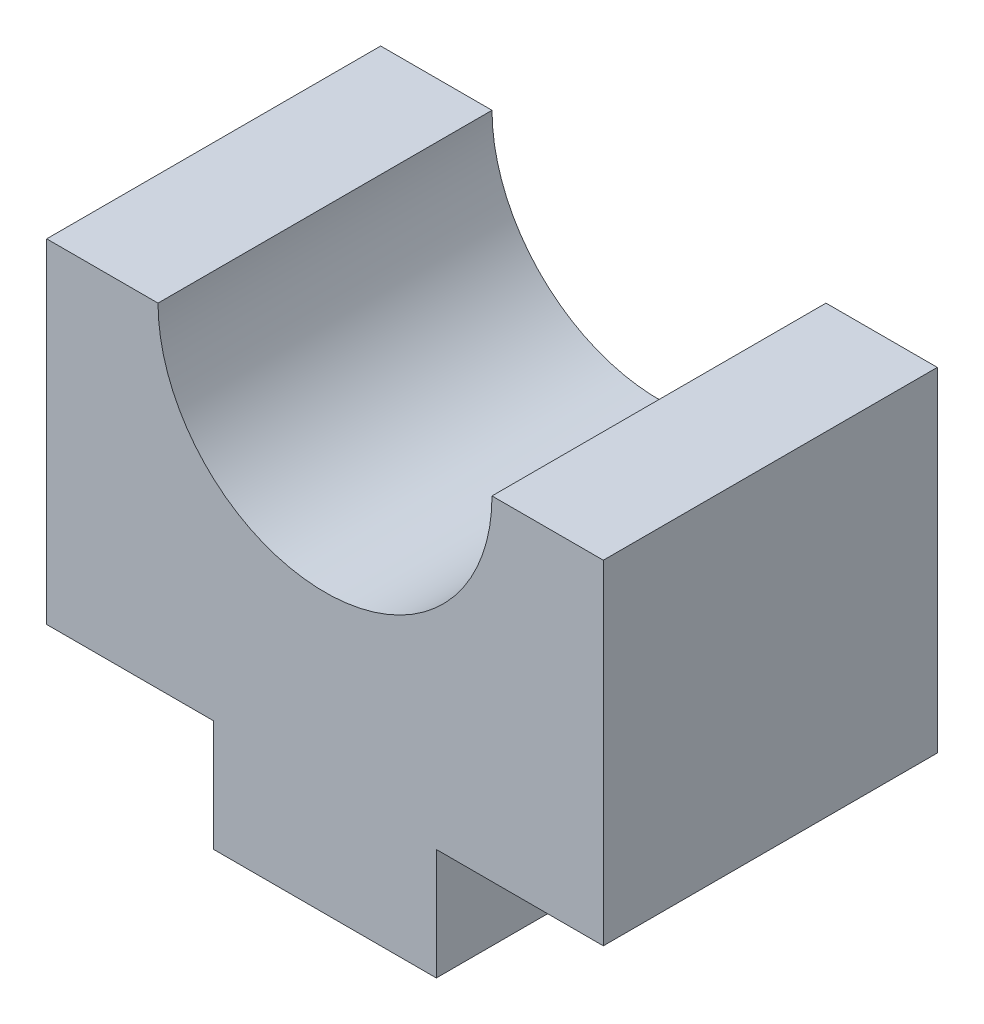
ISO-10303-21;
HEADER;
FILE_DESCRIPTION(('STEP AP214'),'2;1');
FILE_NAME('part.step','',(''),(''),'','','');
FILE_SCHEMA(('AUTOMOTIVE_DESIGN { 1 0 10303 214 1 1 1 1 }'));
ENDSEC;
DATA;
#1=APPLICATION_CONTEXT('core data for automotive mechanical design processes');
#2=APPLICATION_PROTOCOL_DEFINITION('international standard','automotive_design',2000,#1);
#3=PRODUCT_CONTEXT('',#1,'mechanical');
#4=PRODUCT('Part','Part','',(#3));
#5=PRODUCT_RELATED_PRODUCT_CATEGORY('part','',(#4));
#6=PRODUCT_DEFINITION_FORMATION('','',#4);
#7=PRODUCT_DEFINITION_CONTEXT('part definition',#1,'design');
#8=PRODUCT_DEFINITION('design','',#6,#7);
#9=PRODUCT_DEFINITION_SHAPE('','',#8);
#10=(LENGTH_UNIT() NAMED_UNIT(*) SI_UNIT(.MILLI.,.METRE.));
#11=(NAMED_UNIT(*) PLANE_ANGLE_UNIT() SI_UNIT($,.RADIAN.));
#12=(NAMED_UNIT(*) SI_UNIT($,.STERADIAN.) SOLID_ANGLE_UNIT());
#13=UNCERTAINTY_MEASURE_WITH_UNIT(LENGTH_MEASURE(1.E-05),#10,'distance_accuracy_value','');
#14=(GEOMETRIC_REPRESENTATION_CONTEXT(3) GLOBAL_UNCERTAINTY_ASSIGNED_CONTEXT((#13)) GLOBAL_UNIT_ASSIGNED_CONTEXT((#10,
#11,#12)) REPRESENTATION_CONTEXT('',''));
#15=CARTESIAN_POINT('',(0.,0.,0.));
#16=DIRECTION('',(0.,0.,1.));
#17=DIRECTION('',(1.,0.,0.));
#18=AXIS2_PLACEMENT_3D('',#15,#16,#17);
#19=CARTESIAN_POINT('',(0.,0.,-15.));
#20=DIRECTION('',(-1.,0.,0.));
#21=DIRECTION('',(0.,0.,1.));
#22=AXIS2_PLACEMENT_3D('',#19,#20,#21);
#23=PLANE('',#22);
#24=DIRECTION('',(0.,-1.,0.));
#25=VECTOR('',#24,1.);
#26=CARTESIAN_POINT('',(0.,0.,0.));
#27=LINE('',#26,#25);
#28=CARTESIAN_POINT('',(0.,5.,0.));
#29=VERTEX_POINT('',#28);
#30=CARTESIAN_POINT('',(0.,0.,0.));
#31=VERTEX_POINT('',#30);
#32=EDGE_CURVE('E142',#29,#31,#27,.T.);
#33=ORIENTED_EDGE('',*,*,#32,.F.);
#34=DIRECTION('',(0.,0.,1.));
#35=VECTOR('',#34,1.);
#36=CARTESIAN_POINT('',(0.,5.,-15.));
#37=LINE('',#36,#35);
#38=CARTESIAN_POINT('',(0.,5.,-15.));
#39=VERTEX_POINT('',#38);
#40=EDGE_CURVE('E11',#39,#29,#37,.T.);
#41=ORIENTED_EDGE('',*,*,#40,.F.);
#42=DIRECTION('',(0.,-1.,0.));
#43=VECTOR('',#42,1.);
#44=CARTESIAN_POINT('',(0.,0.,-15.));
#45=LINE('',#44,#43);
#46=CARTESIAN_POINT('',(0.,0.,-15.));
#47=VERTEX_POINT('',#46);
#48=EDGE_CURVE('E168',#39,#47,#45,.T.);
#49=ORIENTED_EDGE('',*,*,#48,.T.);
#50=DIRECTION('',(0.,0.,1.));
#51=VECTOR('',#50,1.);
#52=CARTESIAN_POINT('',(0.,0.,-15.));
#53=LINE('',#52,#51);
#54=EDGE_CURVE('E36',#47,#31,#53,.T.);
#55=ORIENTED_EDGE('',*,*,#54,.T.);
#56=EDGE_LOOP('',(#33,#41,#49,#55));
#57=FACE_BOUND('',#56,.T.);
#58=ADVANCED_FACE('F33',(#57),#23,.T.);
#59=CARTESIAN_POINT('',(0.,5.,-15.));
#60=DIRECTION('',(0.,-1.,0.));
#61=DIRECTION('',(0.,0.,-1.));
#62=AXIS2_PLACEMENT_3D('',#59,#60,#61);
#63=PLANE('',#62);
#64=DIRECTION('',(1.,0.,0.));
#65=VECTOR('',#64,1.);
#66=CARTESIAN_POINT('',(0.,5.,0.));
#67=LINE('',#66,#65);
#68=CARTESIAN_POINT('',(-7.5,5.,0.));
#69=VERTEX_POINT('',#68);
#70=EDGE_CURVE('E166',#69,#29,#67,.T.);
#71=ORIENTED_EDGE('',*,*,#70,.F.);
#72=DIRECTION('',(0.,0.,1.));
#73=VECTOR('',#72,1.);
#74=CARTESIAN_POINT('',(-7.5,5.,-15.));
#75=LINE('',#74,#73);
#76=CARTESIAN_POINT('',(-7.5,5.,-15.));
#77=VERTEX_POINT('',#76);
#78=EDGE_CURVE('E42',#77,#69,#75,.T.);
#79=ORIENTED_EDGE('',*,*,#78,.F.);
#80=DIRECTION('',(1.,0.,0.));
#81=VECTOR('',#80,1.);
#82=CARTESIAN_POINT('',(0.,5.,-15.));
#83=LINE('',#82,#81);
#84=EDGE_CURVE('E132',#77,#39,#83,.T.);
#85=ORIENTED_EDGE('',*,*,#84,.T.);
#86=ORIENTED_EDGE('',*,*,#40,.T.);
#87=EDGE_LOOP('',(#71,#79,#85,#86));
#88=FACE_BOUND('',#87,.T.);
#89=ADVANCED_FACE('F184',(#88),#63,.T.);
#90=CARTESIAN_POINT('',(-7.5,5.,-15.));
#91=DIRECTION('',(-1.,0.,0.));
#92=DIRECTION('',(0.,0.,1.));
#93=AXIS2_PLACEMENT_3D('',#90,#91,#92);
#94=PLANE('',#93);
#95=DIRECTION('',(0.,-1.,0.));
#96=VECTOR('',#95,1.);
#97=CARTESIAN_POINT('',(-7.5,5.,0.));
#98=LINE('',#97,#96);
#99=CARTESIAN_POINT('',(-7.5,20.,0.));
#100=VERTEX_POINT('',#99);
#101=EDGE_CURVE('E119',#100,#69,#98,.T.);
#102=ORIENTED_EDGE('',*,*,#101,.F.);
#103=DIRECTION('',(0.,0.,1.));
#104=VECTOR('',#103,1.);
#105=CARTESIAN_POINT('',(-7.5,20.,-15.));
#106=LINE('',#105,#104);
#107=CARTESIAN_POINT('',(-7.5,20.,-15.));
#108=VERTEX_POINT('',#107);
#109=EDGE_CURVE('E114',#108,#100,#106,.T.);
#110=ORIENTED_EDGE('',*,*,#109,.F.);
#111=DIRECTION('',(0.,-1.,0.));
#112=VECTOR('',#111,1.);
#113=CARTESIAN_POINT('',(-7.5,5.,-15.));
#114=LINE('',#113,#112);
#115=EDGE_CURVE('E117',#108,#77,#114,.T.);
#116=ORIENTED_EDGE('',*,*,#115,.T.);
#117=ORIENTED_EDGE('',*,*,#78,.T.);
#118=EDGE_LOOP('',(#102,#110,#116,#117));
#119=FACE_BOUND('',#118,.T.);
#120=ADVANCED_FACE('F116',(#119),#94,.T.);
#121=CARTESIAN_POINT('',(-7.5,20.,-15.));
#122=DIRECTION('',(0.,1.,0.));
#123=DIRECTION('',(0.,0.,1.));
#124=AXIS2_PLACEMENT_3D('',#121,#122,#123);
#125=PLANE('',#124);
#126=DIRECTION('',(-1.,0.,0.));
#127=VECTOR('',#126,1.);
#128=CARTESIAN_POINT('',(-7.5,20.,0.));
#129=LINE('',#128,#127);
#130=CARTESIAN_POINT('',(-2.5,20.,0.));
#131=VERTEX_POINT('',#130);
#132=EDGE_CURVE('E163',#131,#100,#129,.T.);
#133=ORIENTED_EDGE('',*,*,#132,.F.);
#134=DIRECTION('',(0.,0.,1.));
#135=VECTOR('',#134,1.);
#136=CARTESIAN_POINT('',(-2.5,20.,-15.));
#137=LINE('',#136,#135);
#138=CARTESIAN_POINT('',(-2.5,20.,-15.));
#139=VERTEX_POINT('',#138);
#140=EDGE_CURVE('E124',#139,#131,#137,.T.);
#141=ORIENTED_EDGE('',*,*,#140,.F.);
#142=DIRECTION('',(-1.,0.,0.));
#143=VECTOR('',#142,1.);
#144=CARTESIAN_POINT('',(-7.5,20.,-15.));
#145=LINE('',#144,#143);
#146=EDGE_CURVE('E130',#139,#108,#145,.T.);
#147=ORIENTED_EDGE('',*,*,#146,.T.);
#148=ORIENTED_EDGE('',*,*,#109,.T.);
#149=EDGE_LOOP('',(#133,#141,#147,#148));
#150=FACE_BOUND('',#149,.T.);
#151=ADVANCED_FACE('F134',(#150),#125,.T.);
#152=CARTESIAN_POINT('',(5.,20.,-15.));
#153=DIRECTION('',(0.,0.,1.));
#154=DIRECTION('',(1.,0.,0.));
#155=AXIS2_PLACEMENT_3D('',#152,#153,#154);
#156=CYLINDRICAL_SURFACE('',#155,7.5);
#157=CARTESIAN_POINT('',(5.,20.,0.));
#158=DIRECTION('',(0.,0.,-1.));
#159=DIRECTION('',(1.,0.,0.));
#160=AXIS2_PLACEMENT_3D('',#157,#158,#159);
#161=CIRCLE('',#160,7.5);
#162=CARTESIAN_POINT('',(12.5,20.,0.));
#163=VERTEX_POINT('',#162);
#164=EDGE_CURVE('E160',#163,#131,#161,.T.);
#165=ORIENTED_EDGE('',*,*,#164,.F.);
#166=DIRECTION('',(0.,0.,1.));
#167=VECTOR('',#166,1.);
#168=CARTESIAN_POINT('',(12.5,20.,-15.));
#169=LINE('',#168,#167);
#170=CARTESIAN_POINT('',(12.5,20.,-15.));
#171=VERTEX_POINT('',#170);
#172=EDGE_CURVE('E172',#171,#163,#169,.T.);
#173=ORIENTED_EDGE('',*,*,#172,.F.);
#174=CARTESIAN_POINT('',(5.,20.,-15.));
#175=DIRECTION('',(0.,0.,-1.));
#176=DIRECTION('',(1.,0.,0.));
#177=AXIS2_PLACEMENT_3D('',#174,#175,#176);
#178=CIRCLE('',#177,7.5);
#179=EDGE_CURVE('E135',#171,#139,#178,.T.);
#180=ORIENTED_EDGE('',*,*,#179,.T.);
#181=ORIENTED_EDGE('',*,*,#140,.T.);
#182=EDGE_LOOP('',(#165,#173,#180,#181));
#183=FACE_BOUND('',#182,.T.);
#184=ADVANCED_FACE('F197',(#183),#156,.F.);
#185=CARTESIAN_POINT('',(17.5,20.,-15.));
#186=DIRECTION('',(0.,1.,0.));
#187=DIRECTION('',(-1.,0.,0.));
#188=AXIS2_PLACEMENT_3D('',#185,#186,#187);
#189=PLANE('',#188);
#190=DIRECTION('',(-1.,0.,0.));
#191=VECTOR('',#190,1.);
#192=CARTESIAN_POINT('',(17.5,20.,0.));
#193=LINE('',#192,#191);
#194=CARTESIAN_POINT('',(17.5,20.,0.));
#195=VERTEX_POINT('',#194);
#196=EDGE_CURVE('E157',#195,#163,#193,.T.);
#197=ORIENTED_EDGE('',*,*,#196,.F.);
#198=DIRECTION('',(0.,0.,1.));
#199=VECTOR('',#198,1.);
#200=CARTESIAN_POINT('',(17.5,20.,-15.));
#201=LINE('',#200,#199);
#202=CARTESIAN_POINT('',(17.5,20.,-15.));
#203=VERTEX_POINT('',#202);
#204=EDGE_CURVE('E174',#203,#195,#201,.T.);
#205=ORIENTED_EDGE('',*,*,#204,.F.);
#206=DIRECTION('',(-1.,0.,0.));
#207=VECTOR('',#206,1.);
#208=CARTESIAN_POINT('',(17.5,20.,-15.));
#209=LINE('',#208,#207);
#210=EDGE_CURVE('E137',#203,#171,#209,.T.);
#211=ORIENTED_EDGE('',*,*,#210,.T.);
#212=ORIENTED_EDGE('',*,*,#172,.T.);
#213=EDGE_LOOP('',(#197,#205,#211,#212));
#214=FACE_BOUND('',#213,.T.);
#215=ADVANCED_FACE('F200',(#214),#189,.T.);
#216=CARTESIAN_POINT('',(17.5,5.,-15.));
#217=DIRECTION('',(1.,0.,0.));
#218=DIRECTION('',(0.,0.,-1.));
#219=AXIS2_PLACEMENT_3D('',#216,#217,#218);
#220=PLANE('',#219);
#221=DIRECTION('',(0.,1.,0.));
#222=VECTOR('',#221,1.);
#223=CARTESIAN_POINT('',(17.5,5.,0.));
#224=LINE('',#223,#222);
#225=CARTESIAN_POINT('',(17.5,5.,0.));
#226=VERTEX_POINT('',#225);
#227=EDGE_CURVE('E154',#226,#195,#224,.T.);
#228=ORIENTED_EDGE('',*,*,#227,.F.);
#229=DIRECTION('',(0.,0.,1.));
#230=VECTOR('',#229,1.);
#231=CARTESIAN_POINT('',(17.5,5.,-15.));
#232=LINE('',#231,#230);
#233=CARTESIAN_POINT('',(17.5,5.,-15.));
#234=VERTEX_POINT('',#233);
#235=EDGE_CURVE('E176',#234,#226,#232,.T.);
#236=ORIENTED_EDGE('',*,*,#235,.F.);
#237=DIRECTION('',(0.,1.,0.));
#238=VECTOR('',#237,1.);
#239=CARTESIAN_POINT('',(17.5,5.,-15.));
#240=LINE('',#239,#238);
#241=EDGE_CURVE('E299',#234,#203,#240,.T.);
#242=ORIENTED_EDGE('',*,*,#241,.T.);
#243=ORIENTED_EDGE('',*,*,#204,.T.);
#244=EDGE_LOOP('',(#228,#236,#242,#243));
#245=FACE_BOUND('',#244,.T.);
#246=ADVANCED_FACE('F204',(#245),#220,.T.);
#247=CARTESIAN_POINT('',(10.,5.,-15.));
#248=DIRECTION('',(0.,-1.,0.));
#249=DIRECTION('',(0.,0.,-1.));
#250=AXIS2_PLACEMENT_3D('',#247,#248,#249);
#251=PLANE('',#250);
#252=DIRECTION('',(1.,0.,0.));
#253=VECTOR('',#252,1.);
#254=CARTESIAN_POINT('',(10.,5.,0.));
#255=LINE('',#254,#253);
#256=CARTESIAN_POINT('',(10.,5.,0.));
#257=VERTEX_POINT('',#256);
#258=EDGE_CURVE('E151',#257,#226,#255,.T.);
#259=ORIENTED_EDGE('',*,*,#258,.F.);
#260=DIRECTION('',(0.,0.,1.));
#261=VECTOR('',#260,1.);
#262=CARTESIAN_POINT('',(10.,5.,-15.));
#263=LINE('',#262,#261);
#264=CARTESIAN_POINT('',(10.,5.,-15.));
#265=VERTEX_POINT('',#264);
#266=EDGE_CURVE('E178',#265,#257,#263,.T.);
#267=ORIENTED_EDGE('',*,*,#266,.F.);
#268=DIRECTION('',(1.,0.,0.));
#269=VECTOR('',#268,1.);
#270=CARTESIAN_POINT('',(10.,5.,-15.));
#271=LINE('',#270,#269);
#272=EDGE_CURVE('E295',#265,#234,#271,.T.);
#273=ORIENTED_EDGE('',*,*,#272,.T.);
#274=ORIENTED_EDGE('',*,*,#235,.T.);
#275=EDGE_LOOP('',(#259,#267,#273,#274));
#276=FACE_BOUND('',#275,.T.);
#277=ADVANCED_FACE('F208',(#276),#251,.T.);
#278=CARTESIAN_POINT('',(10.,0.,-15.));
#279=DIRECTION('',(1.,0.,0.));
#280=DIRECTION('',(0.,0.,-1.));
#281=AXIS2_PLACEMENT_3D('',#278,#279,#280);
#282=PLANE('',#281);
#283=DIRECTION('',(0.,1.,0.));
#284=VECTOR('',#283,1.);
#285=CARTESIAN_POINT('',(10.,0.,0.));
#286=LINE('',#285,#284);
#287=CARTESIAN_POINT('',(10.,0.,0.));
#288=VERTEX_POINT('',#287);
#289=EDGE_CURVE('E148',#288,#257,#286,.T.);
#290=ORIENTED_EDGE('',*,*,#289,.F.);
#291=DIRECTION('',(0.,0.,1.));
#292=VECTOR('',#291,1.);
#293=CARTESIAN_POINT('',(10.,0.,-15.));
#294=LINE('',#293,#292);
#295=CARTESIAN_POINT('',(10.,0.,-15.));
#296=VERTEX_POINT('',#295);
#297=EDGE_CURVE('E179',#296,#288,#294,.T.);
#298=ORIENTED_EDGE('',*,*,#297,.F.);
#299=DIRECTION('',(0.,1.,0.));
#300=VECTOR('',#299,1.);
#301=CARTESIAN_POINT('',(10.,0.,-15.));
#302=LINE('',#301,#300);
#303=EDGE_CURVE('E306',#296,#265,#302,.T.);
#304=ORIENTED_EDGE('',*,*,#303,.T.);
#305=ORIENTED_EDGE('',*,*,#266,.T.);
#306=EDGE_LOOP('',(#290,#298,#304,#305));
#307=FACE_BOUND('',#306,.T.);
#308=ADVANCED_FACE('F212',(#307),#282,.T.);
#309=CARTESIAN_POINT('',(0.,0.,-15.));
#310=DIRECTION('',(0.,-1.,0.));
#311=DIRECTION('',(0.,0.,-1.));
#312=AXIS2_PLACEMENT_3D('',#309,#310,#311);
#313=PLANE('',#312);
#314=DIRECTION('',(1.,0.,0.));
#315=VECTOR('',#314,1.);
#316=CARTESIAN_POINT('',(0.,0.,0.));
#317=LINE('',#316,#315);
#318=EDGE_CURVE('E145',#31,#288,#317,.T.);
#319=ORIENTED_EDGE('',*,*,#318,.F.);
#320=ORIENTED_EDGE('',*,*,#54,.F.);
#321=DIRECTION('',(1.,0.,0.));
#322=VECTOR('',#321,1.);
#323=CARTESIAN_POINT('',(0.,0.,-15.));
#324=LINE('',#323,#322);
#325=EDGE_CURVE('E308',#47,#296,#324,.T.);
#326=ORIENTED_EDGE('',*,*,#325,.T.);
#327=ORIENTED_EDGE('',*,*,#297,.T.);
#328=EDGE_LOOP('',(#319,#320,#326,#327));
#329=FACE_BOUND('',#328,.T.);
#330=ADVANCED_FACE('F181',(#329),#313,.T.);
#331=CARTESIAN_POINT('',(5.,20.,-15.));
#332=DIRECTION('',(0.,0.,1.));
#333=DIRECTION('',(1.,0.,0.));
#334=AXIS2_PLACEMENT_3D('',#331,#332,#333);
#335=PLANE('',#334);
#336=ORIENTED_EDGE('',*,*,#48,.F.);
#337=ORIENTED_EDGE('',*,*,#84,.F.);
#338=ORIENTED_EDGE('',*,*,#115,.F.);
#339=ORIENTED_EDGE('',*,*,#146,.F.);
#340=ORIENTED_EDGE('',*,*,#179,.F.);
#341=ORIENTED_EDGE('',*,*,#210,.F.);
#342=ORIENTED_EDGE('',*,*,#241,.F.);
#343=ORIENTED_EDGE('',*,*,#272,.F.);
#344=ORIENTED_EDGE('',*,*,#303,.F.);
#345=ORIENTED_EDGE('',*,*,#325,.F.);
#346=EDGE_LOOP('',(#336,#337,#338,#339,#340,#341,#342,#343,#344,#345));
#347=FACE_BOUND('',#346,.T.);
#348=ADVANCED_FACE('F128',(#347),#335,.F.);
#349=CARTESIAN_POINT('',(5.,20.,0.));
#350=DIRECTION('',(0.,0.,1.));
#351=DIRECTION('',(1.,0.,0.));
#352=AXIS2_PLACEMENT_3D('',#349,#350,#351);
#353=PLANE('',#352);
#354=ORIENTED_EDGE('',*,*,#32,.T.);
#355=ORIENTED_EDGE('',*,*,#318,.T.);
#356=ORIENTED_EDGE('',*,*,#289,.T.);
#357=ORIENTED_EDGE('',*,*,#258,.T.);
#358=ORIENTED_EDGE('',*,*,#227,.T.);
#359=ORIENTED_EDGE('',*,*,#196,.T.);
#360=ORIENTED_EDGE('',*,*,#164,.T.);
#361=ORIENTED_EDGE('',*,*,#132,.T.);
#362=ORIENTED_EDGE('',*,*,#101,.T.);
#363=ORIENTED_EDGE('',*,*,#70,.T.);
#364=EDGE_LOOP('',(#354,#355,#356,#357,#358,#359,#360,#361,#362,#363));
#365=FACE_BOUND('',#364,.T.);
#366=ADVANCED_FACE('F183',(#365),#353,.T.);
#367=CLOSED_SHELL('',(#58,#89,#120,#151,#184,#215,#246,#277,#308,#330,#348,#366));
#368=MANIFOLD_SOLID_BREP('B2',#367);
#369=ADVANCED_BREP_SHAPE_REPRESENTATION('',(#18,#368),#14);
#370=SHAPE_DEFINITION_REPRESENTATION(#9,#369);
ENDSEC;
END-ISO-10303-21;
